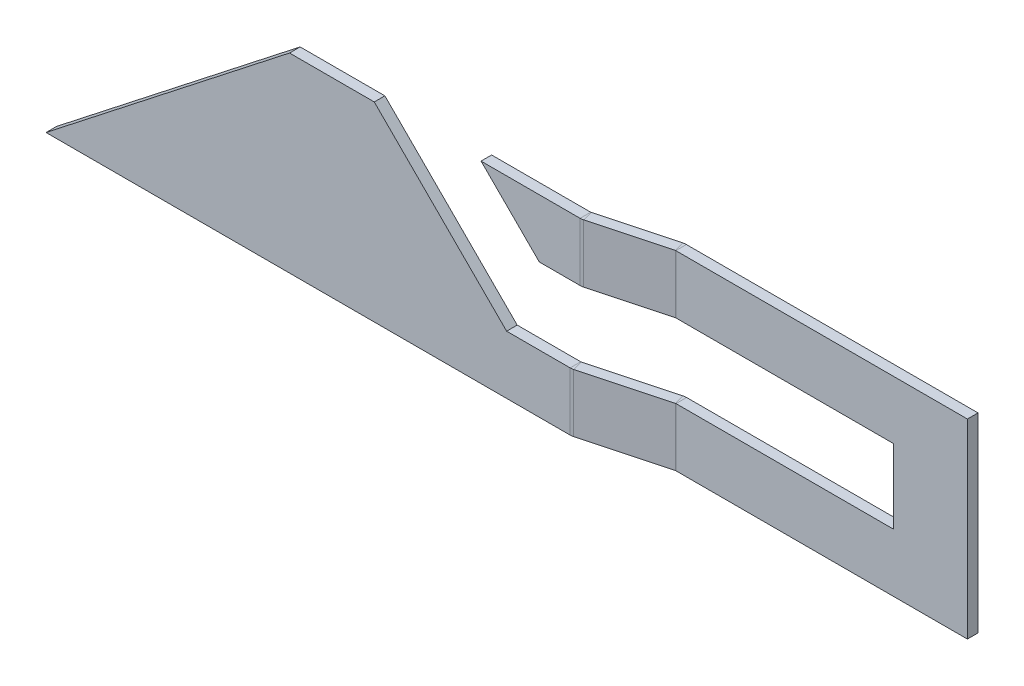
ISO-10303-21;
HEADER;
FILE_DESCRIPTION(('STEP AP214'),'2;1');
FILE_NAME('part.step','',(''),(''),'','','');
FILE_SCHEMA(('AUTOMOTIVE_DESIGN { 1 0 10303 214 1 1 1 1 }'));
ENDSEC;
DATA;
#1=APPLICATION_CONTEXT('core data for automotive mechanical design processes');
#2=APPLICATION_PROTOCOL_DEFINITION('international standard','automotive_design',2000,#1);
#3=PRODUCT_CONTEXT('',#1,'mechanical');
#4=PRODUCT('Part','Part','',(#3));
#5=PRODUCT_RELATED_PRODUCT_CATEGORY('part','',(#4));
#6=PRODUCT_DEFINITION_FORMATION('','',#4);
#7=PRODUCT_DEFINITION_CONTEXT('part definition',#1,'design');
#8=PRODUCT_DEFINITION('design','',#6,#7);
#9=PRODUCT_DEFINITION_SHAPE('','',#8);
#10=(LENGTH_UNIT() NAMED_UNIT(*) SI_UNIT(.MILLI.,.METRE.));
#11=(NAMED_UNIT(*) PLANE_ANGLE_UNIT() SI_UNIT($,.RADIAN.));
#12=(NAMED_UNIT(*) SI_UNIT($,.STERADIAN.) SOLID_ANGLE_UNIT());
#13=UNCERTAINTY_MEASURE_WITH_UNIT(LENGTH_MEASURE(1.E-05),#10,'distance_accuracy_value','');
#14=(GEOMETRIC_REPRESENTATION_CONTEXT(3) GLOBAL_UNCERTAINTY_ASSIGNED_CONTEXT((#13)) GLOBAL_UNIT_ASSIGNED_CONTEXT((#10,
#11,#12)) REPRESENTATION_CONTEXT('',''));
#15=CARTESIAN_POINT('',(0.,0.,0.));
#16=DIRECTION('',(0.,0.,1.));
#17=DIRECTION('',(1.,0.,0.));
#18=AXIS2_PLACEMENT_3D('',#15,#16,#17);
#19=CARTESIAN_POINT('',(0.,0.,-5.));
#20=DIRECTION('',(0.,-1.,0.));
#21=DIRECTION('',(1.,0.,0.));
#22=AXIS2_PLACEMENT_3D('',#19,#20,#21);
#23=PLANE('',#22);
#24=DIRECTION('',(1.,0.,0.));
#25=VECTOR('',#24,1.);
#26=CARTESIAN_POINT('',(0.,0.,0.));
#27=LINE('',#26,#25);
#28=CARTESIAN_POINT('',(-117.797199499532,0.,0.));
#29=VERTEX_POINT('',#28);
#30=CARTESIAN_POINT('',(129.702800500468,0.,0.));
#31=VERTEX_POINT('',#30);
#32=EDGE_CURVE('E541',#29,#31,#27,.T.);
#33=ORIENTED_EDGE('',*,*,#32,.F.);
#34=DIRECTION('',(0.,0.,1.));
#35=VECTOR('',#34,1.);
#36=CARTESIAN_POINT('',(-117.797199499532,0.,-5.));
#37=LINE('',#36,#35);
#38=CARTESIAN_POINT('',(-117.797199499532,0.,-5.));
#39=VERTEX_POINT('',#38);
#40=EDGE_CURVE('E13',#39,#29,#37,.T.);
#41=ORIENTED_EDGE('',*,*,#40,.F.);
#42=DIRECTION('',(1.,0.,0.));
#43=VECTOR('',#42,1.);
#44=CARTESIAN_POINT('',(129.702800500468,0.,-5.));
#45=LINE('',#44,#43);
#46=CARTESIAN_POINT('',(129.702800500468,0.,-4.99999999999999));
#47=VERTEX_POINT('',#46);
#48=EDGE_CURVE('E156',#39,#47,#45,.T.);
#49=ORIENTED_EDGE('',*,*,#48,.T.);
#50=DIRECTION('',(0.,0.,1.));
#51=VECTOR('',#50,1.);
#52=CARTESIAN_POINT('',(129.702800500468,0.,-5.));
#53=LINE('',#52,#51);
#54=EDGE_CURVE('E141',#47,#31,#53,.T.);
#55=ORIENTED_EDGE('',*,*,#54,.T.);
#56=EDGE_LOOP('',(#33,#41,#49,#55));
#57=FACE_BOUND('',#56,.T.);
#58=ADVANCED_FACE('F137',(#57),#23,.T.);
#59=CARTESIAN_POINT('',(-117.797199499532,0.,-5.));
#60=DIRECTION('',(-0.616308261658111,0.787505001007586,0.));
#61=DIRECTION('',(-0.787505001007586,-0.616308261658111,0.));
#62=AXIS2_PLACEMENT_3D('',#59,#60,#61);
#63=PLANE('',#62);
#64=DIRECTION('',(-0.787505001007586,-0.616308261658111,0.));
#65=VECTOR('',#64,1.);
#66=CARTESIAN_POINT('',(-117.797199499532,0.,0.));
#67=LINE('',#66,#65);
#68=CARTESIAN_POINT('',(-2.79719949953231,90.,0.));
#69=VERTEX_POINT('',#68);
#70=EDGE_CURVE('E563',#69,#29,#67,.T.);
#71=ORIENTED_EDGE('',*,*,#70,.F.);
#72=DIRECTION('',(0.,0.,1.));
#73=VECTOR('',#72,1.);
#74=CARTESIAN_POINT('',(-2.79719949953231,90.,-5.));
#75=LINE('',#74,#73);
#76=CARTESIAN_POINT('',(-2.79719949953231,90.,-5.));
#77=VERTEX_POINT('',#76);
#78=EDGE_CURVE('E147',#77,#69,#75,.T.);
#79=ORIENTED_EDGE('',*,*,#78,.F.);
#80=DIRECTION('',(-0.787505001007586,-0.616308261658111,0.));
#81=VECTOR('',#80,1.);
#82=CARTESIAN_POINT('',(-117.797199499532,0.,-5.));
#83=LINE('',#82,#81);
#84=EDGE_CURVE('E550',#77,#39,#83,.T.);
#85=ORIENTED_EDGE('',*,*,#84,.T.);
#86=ORIENTED_EDGE('',*,*,#40,.T.);
#87=EDGE_LOOP('',(#71,#79,#85,#86));
#88=FACE_BOUND('',#87,.T.);
#89=ADVANCED_FACE('F699',(#88),#63,.T.);
#90=CARTESIAN_POINT('',(-2.79719949953231,90.,-5.));
#91=DIRECTION('',(0.,1.,0.));
#92=DIRECTION('',(0.,0.,1.));
#93=AXIS2_PLACEMENT_3D('',#90,#91,#92);
#94=PLANE('',#93);
#95=DIRECTION('',(-1.,0.,0.));
#96=VECTOR('',#95,1.);
#97=CARTESIAN_POINT('',(-2.79719949953231,90.,0.));
#98=LINE('',#97,#96);
#99=CARTESIAN_POINT('',(37.2028005004677,90.,0.));
#100=VERTEX_POINT('',#99);
#101=EDGE_CURVE('E560',#100,#69,#98,.T.);
#102=ORIENTED_EDGE('',*,*,#101,.F.);
#103=DIRECTION('',(0.,0.,1.));
#104=VECTOR('',#103,1.);
#105=CARTESIAN_POINT('',(37.2028005004677,90.,-5.));
#106=LINE('',#105,#104);
#107=CARTESIAN_POINT('',(37.2028005004677,90.,-5.));
#108=VERTEX_POINT('',#107);
#109=EDGE_CURVE('E568',#108,#100,#106,.T.);
#110=ORIENTED_EDGE('',*,*,#109,.F.);
#111=DIRECTION('',(-1.,0.,0.));
#112=VECTOR('',#111,1.);
#113=CARTESIAN_POINT('',(-2.79719949953231,90.,-5.));
#114=LINE('',#113,#112);
#115=EDGE_CURVE('E548',#108,#77,#114,.T.);
#116=ORIENTED_EDGE('',*,*,#115,.T.);
#117=ORIENTED_EDGE('',*,*,#78,.T.);
#118=EDGE_LOOP('',(#102,#110,#116,#117));
#119=FACE_BOUND('',#118,.T.);
#120=ADVANCED_FACE('F704',(#119),#94,.T.);
#121=CARTESIAN_POINT('',(37.2028005004677,90.,-5.));
#122=DIRECTION('',(0.707106781186548,0.707106781186548,0.));
#123=DIRECTION('',(-0.707106781186548,0.707106781186548,0.));
#124=AXIS2_PLACEMENT_3D('',#121,#122,#123);
#125=PLANE('',#124);
#126=DIRECTION('',(-0.707106781186548,0.707106781186548,0.));
#127=VECTOR('',#126,1.);
#128=CARTESIAN_POINT('',(37.2028005004677,90.,0.));
#129=LINE('',#128,#127);
#130=CARTESIAN_POINT('',(99.7028005004677,27.5,0.));
#131=VERTEX_POINT('',#130);
#132=EDGE_CURVE('E557',#131,#100,#129,.T.);
#133=ORIENTED_EDGE('',*,*,#132,.F.);
#134=DIRECTION('',(0.,0.,1.));
#135=VECTOR('',#134,1.);
#136=CARTESIAN_POINT('',(99.7028005004677,27.5,-5.));
#137=LINE('',#136,#135);
#138=CARTESIAN_POINT('',(99.7028005004677,27.5,-5.));
#139=VERTEX_POINT('',#138);
#140=EDGE_CURVE('E187',#139,#131,#137,.T.);
#141=ORIENTED_EDGE('',*,*,#140,.F.);
#142=DIRECTION('',(-0.707106781186548,0.707106781186548,0.));
#143=VECTOR('',#142,1.);
#144=CARTESIAN_POINT('',(37.2028005004677,90.,-5.));
#145=LINE('',#144,#143);
#146=EDGE_CURVE('E546',#139,#108,#145,.T.);
#147=ORIENTED_EDGE('',*,*,#146,.T.);
#148=ORIENTED_EDGE('',*,*,#109,.T.);
#149=EDGE_LOOP('',(#133,#141,#147,#148));
#150=FACE_BOUND('',#149,.T.);
#151=ADVANCED_FACE('F710',(#150),#125,.T.);
#152=CARTESIAN_POINT('',(99.7028005004677,27.5,-5.));
#153=DIRECTION('',(0.,1.,0.));
#154=DIRECTION('',(0.,0.,1.));
#155=AXIS2_PLACEMENT_3D('',#152,#153,#154);
#156=PLANE('',#155);
#157=DIRECTION('',(-1.,0.,0.));
#158=VECTOR('',#157,1.);
#159=CARTESIAN_POINT('',(99.7028005004677,27.5,0.));
#160=LINE('',#159,#158);
#161=CARTESIAN_POINT('',(129.702800500468,27.5,0.));
#162=VERTEX_POINT('',#161);
#163=EDGE_CURVE('E554',#162,#131,#160,.T.);
#164=ORIENTED_EDGE('',*,*,#163,.F.);
#165=DIRECTION('',(0.,0.,1.));
#166=VECTOR('',#165,1.);
#167=CARTESIAN_POINT('',(129.702800500468,27.5,-5.));
#168=LINE('',#167,#166);
#169=CARTESIAN_POINT('',(129.702800500468,27.5,-4.99999999999999));
#170=VERTEX_POINT('',#169);
#171=EDGE_CURVE('E570',#170,#162,#168,.T.);
#172=ORIENTED_EDGE('',*,*,#171,.F.);
#173=DIRECTION('',(-1.,0.,0.));
#174=VECTOR('',#173,1.);
#175=CARTESIAN_POINT('',(99.7028005004677,27.5,-5.));
#176=LINE('',#175,#174);
#177=EDGE_CURVE('E543',#170,#139,#176,.T.);
#178=ORIENTED_EDGE('',*,*,#177,.T.);
#179=ORIENTED_EDGE('',*,*,#140,.T.);
#180=EDGE_LOOP('',(#164,#172,#178,#179));
#181=FACE_BOUND('',#180,.T.);
#182=ADVANCED_FACE('F139',(#181),#156,.T.);
#183=CARTESIAN_POINT('',(0.,0.,-5.));
#184=DIRECTION('',(0.,0.,1.));
#185=DIRECTION('',(1.,0.,0.));
#186=AXIS2_PLACEMENT_3D('',#183,#184,#185);
#187=PLANE('',#186);
#188=ORIENTED_EDGE('',*,*,#48,.F.);
#189=ORIENTED_EDGE('',*,*,#84,.F.);
#190=ORIENTED_EDGE('',*,*,#115,.F.);
#191=ORIENTED_EDGE('',*,*,#146,.F.);
#192=ORIENTED_EDGE('',*,*,#177,.F.);
#193=DIRECTION('',(0.,1.,0.));
#194=VECTOR('',#193,1.);
#195=CARTESIAN_POINT('',(129.702800500468,27.5,-5.));
#196=LINE('',#195,#194);
#197=EDGE_CURVE('E540',#47,#170,#196,.T.);
#198=ORIENTED_EDGE('',*,*,#197,.F.);
#199=EDGE_LOOP('',(#188,#189,#190,#191,#192,#198));
#200=FACE_BOUND('',#199,.T.);
#201=ADVANCED_FACE('F587',(#200),#187,.F.);
#202=CARTESIAN_POINT('',(0.,0.,0.));
#203=DIRECTION('',(0.,0.,1.));
#204=DIRECTION('',(1.,0.,0.));
#205=AXIS2_PLACEMENT_3D('',#202,#203,#204);
#206=PLANE('',#205);
#207=ORIENTED_EDGE('',*,*,#32,.T.);
#208=DIRECTION('',(0.,1.,0.));
#209=VECTOR('',#208,1.);
#210=CARTESIAN_POINT('',(129.702800500468,27.5,0.));
#211=LINE('',#210,#209);
#212=EDGE_CURVE('E530',#31,#162,#211,.T.);
#213=ORIENTED_EDGE('',*,*,#212,.T.);
#214=ORIENTED_EDGE('',*,*,#163,.T.);
#215=ORIENTED_EDGE('',*,*,#132,.T.);
#216=ORIENTED_EDGE('',*,*,#101,.T.);
#217=ORIENTED_EDGE('',*,*,#70,.T.);
#218=EDGE_LOOP('',(#207,#213,#214,#215,#216,#217));
#219=FACE_BOUND('',#218,.T.);
#220=ADVANCED_FACE('F591',(#219),#206,.T.);
#221=CARTESIAN_POINT('',(129.702800500468,27.5,-5.73660000000001));
#222=DIRECTION('',(0.,1.,0.));
#223=DIRECTION('',(0.,0.,1.));
#224=AXIS2_PLACEMENT_3D('',#221,#222,#223);
#225=PLANE('',#224);
#226=DIRECTION('',(0.258819045102515,0.,0.96592582628907));
#227=VECTOR('',#226,1.);
#228=CARTESIAN_POINT('',(131.187541834603,27.5,-0.195469904910118));
#229=LINE('',#228,#227);
#230=CARTESIAN_POINT('',(129.89344660909,27.5,-5.02509903635547));
#231=VERTEX_POINT('',#230);
#232=CARTESIAN_POINT('',(131.187541834603,27.5,-0.195469904910119));
#233=VERTEX_POINT('',#232);
#234=EDGE_CURVE('E485',#231,#233,#229,.T.);
#235=ORIENTED_EDGE('',*,*,#234,.F.);
#236=CARTESIAN_POINT('',(129.702800500468,27.5,-5.73660000000001));
#237=DIRECTION('',(0.,-1.,0.));
#238=DIRECTION('',(0.,0.,-1.));
#239=AXIS2_PLACEMENT_3D('',#236,#237,#238);
#240=CIRCLE('',#239,0.736600000000015);
#241=EDGE_CURVE('E534',#170,#231,#240,.F.);
#242=ORIENTED_EDGE('',*,*,#241,.F.);
#243=ORIENTED_EDGE('',*,*,#171,.T.);
#244=CARTESIAN_POINT('',(129.702800500468,27.5,-5.73660000000001));
#245=DIRECTION('',(0.,-1.,0.));
#246=DIRECTION('',(0.,0.,-1.));
#247=AXIS2_PLACEMENT_3D('',#244,#245,#246);
#248=CIRCLE('',#247,5.73660000000001);
#249=EDGE_CURVE('E527',#162,#233,#248,.F.);
#250=ORIENTED_EDGE('',*,*,#249,.T.);
#251=EDGE_LOOP('',(#235,#242,#243,#250));
#252=FACE_BOUND('',#251,.T.);
#253=ADVANCED_FACE('F595',(#252),#225,.T.);
#254=CARTESIAN_POINT('',(129.702800500468,0.,-5.73660000000001));
#255=DIRECTION('',(0.,1.,0.));
#256=DIRECTION('',(0.,0.,1.));
#257=AXIS2_PLACEMENT_3D('',#254,#255,#256);
#258=PLANE('',#257);
#259=CARTESIAN_POINT('',(129.702800500468,0.,-5.73660000000001));
#260=DIRECTION('',(0.,-1.,0.));
#261=DIRECTION('',(0.,0.,-1.));
#262=AXIS2_PLACEMENT_3D('',#259,#260,#261);
#263=CIRCLE('',#262,0.736600000000015);
#264=CARTESIAN_POINT('',(129.89344660909,0.,-5.02509903635547));
#265=VERTEX_POINT('',#264);
#266=EDGE_CURVE('E497',#265,#47,#263,.T.);
#267=ORIENTED_EDGE('',*,*,#266,.F.);
#268=DIRECTION('',(0.258819045102515,0.,0.96592582628907));
#269=VECTOR('',#268,1.);
#270=CARTESIAN_POINT('',(129.89344660909,0.,-5.02509903635547));
#271=LINE('',#270,#269);
#272=CARTESIAN_POINT('',(131.187541834603,0.,-0.195469904910119));
#273=VERTEX_POINT('',#272);
#274=EDGE_CURVE('E520',#265,#273,#271,.T.);
#275=ORIENTED_EDGE('',*,*,#274,.T.);
#276=CARTESIAN_POINT('',(129.702800500468,0.,-5.73660000000001));
#277=DIRECTION('',(0.,-1.,0.));
#278=DIRECTION('',(0.,0.,-1.));
#279=AXIS2_PLACEMENT_3D('',#276,#277,#278);
#280=CIRCLE('',#279,5.73660000000001);
#281=EDGE_CURVE('E531',#273,#31,#280,.T.);
#282=ORIENTED_EDGE('',*,*,#281,.T.);
#283=ORIENTED_EDGE('',*,*,#54,.F.);
#284=EDGE_LOOP('',(#267,#275,#282,#283));
#285=FACE_BOUND('',#284,.T.);
#286=ADVANCED_FACE('F581',(#285),#258,.F.);
#287=CARTESIAN_POINT('',(129.702800500468,0.,-5.73660000000001));
#288=DIRECTION('',(0.,-1.,0.));
#289=DIRECTION('',(0.258819045102515,0.,0.96592582628907));
#290=AXIS2_PLACEMENT_3D('',#287,#288,#289);
#291=CYLINDRICAL_SURFACE('',#290,5.73660000000001);
#292=ORIENTED_EDGE('',*,*,#212,.F.);
#293=ORIENTED_EDGE('',*,*,#281,.F.);
#294=DIRECTION('',(0.,-1.,0.));
#295=VECTOR('',#294,1.);
#296=CARTESIAN_POINT('',(131.187541834603,27.5,-0.195469904910119));
#297=LINE('',#296,#295);
#298=EDGE_CURVE('E518',#273,#233,#297,.F.);
#299=ORIENTED_EDGE('',*,*,#298,.T.);
#300=ORIENTED_EDGE('',*,*,#249,.F.);
#301=EDGE_LOOP('',(#292,#293,#299,#300));
#302=FACE_BOUND('',#301,.T.);
#303=ADVANCED_FACE('F593',(#302),#291,.T.);
#304=CARTESIAN_POINT('',(129.702800500468,0.,-5.73660000000001));
#305=DIRECTION('',(0.,-1.,0.));
#306=DIRECTION('',(0.258819045102515,0.,0.96592582628907));
#307=AXIS2_PLACEMENT_3D('',#304,#305,#306);
#308=CYLINDRICAL_SURFACE('',#307,0.736600000000015);
#309=ORIENTED_EDGE('',*,*,#197,.T.);
#310=ORIENTED_EDGE('',*,*,#241,.T.);
#311=DIRECTION('',(0.,-1.,0.));
#312=VECTOR('',#311,1.);
#313=CARTESIAN_POINT('',(129.89344660909,27.5,-5.02509903635547));
#314=LINE('',#313,#312);
#315=EDGE_CURVE('E523',#231,#265,#314,.T.);
#316=ORIENTED_EDGE('',*,*,#315,.T.);
#317=ORIENTED_EDGE('',*,*,#266,.T.);
#318=EDGE_LOOP('',(#309,#310,#316,#317));
#319=FACE_BOUND('',#318,.T.);
#320=ADVANCED_FACE('F584',(#319),#308,.F.);
#321=CARTESIAN_POINT('',(131.093870955703,27.5,-0.170370868554648));
#322=DIRECTION('',(0.,1.,0.));
#323=DIRECTION('',(0.,0.,1.));
#324=AXIS2_PLACEMENT_3D('',#321,#322,#323);
#325=PLANE('',#324);
#326=DIRECTION('',(0.96592582628907,0.,-0.258819045102515));
#327=VECTOR('',#326,1.);
#328=CARTESIAN_POINT('',(7.53541539226132,27.5,27.7606366156551));
#329=LINE('',#328,#327);
#330=CARTESIAN_POINT('',(167.800976044178,27.5,-15.1823909355459));
#331=VERTEX_POINT('',#330);
#332=EDGE_CURVE('E515',#231,#331,#329,.T.);
#333=ORIENTED_EDGE('',*,*,#332,.F.);
#334=ORIENTED_EDGE('',*,*,#234,.T.);
#335=DIRECTION('',(-0.96592582628907,0.,0.258819045102515));
#336=VECTOR('',#335,1.);
#337=CARTESIAN_POINT('',(131.093870955703,27.5,-0.170370868554648));
#338=LINE('',#337,#336);
#339=CARTESIAN_POINT('',(169.09507126969,27.5,-10.3527618041006));
#340=VERTEX_POINT('',#339);
#341=EDGE_CURVE('E506',#233,#340,#338,.F.);
#342=ORIENTED_EDGE('',*,*,#341,.T.);
#343=DIRECTION('',(-0.258819045102515,0.,-0.96592582628907));
#344=VECTOR('',#343,1.);
#345=CARTESIAN_POINT('',(169.09507126969,27.5,-10.3527618041006));
#346=LINE('',#345,#344);
#347=EDGE_CURVE('E498',#340,#331,#346,.T.);
#348=ORIENTED_EDGE('',*,*,#347,.T.);
#349=EDGE_LOOP('',(#333,#334,#342,#348));
#350=FACE_BOUND('',#349,.T.);
#351=ADVANCED_FACE('F599',(#350),#325,.T.);
#352=CARTESIAN_POINT('',(169.09507126969,0.,-10.3527618041006));
#353=DIRECTION('',(0.,-1.,0.));
#354=DIRECTION('',(0.,0.,-1.));
#355=AXIS2_PLACEMENT_3D('',#352,#353,#354);
#356=PLANE('',#355);
#357=DIRECTION('',(0.96592582628907,0.,-0.258819045102515));
#358=VECTOR('',#357,1.);
#359=CARTESIAN_POINT('',(169.09507126969,0.,-10.3527618041006));
#360=LINE('',#359,#358);
#361=CARTESIAN_POINT('',(169.09507126969,0.,-10.3527618041006));
#362=VERTEX_POINT('',#361);
#363=EDGE_CURVE('E501',#362,#273,#360,.F.);
#364=ORIENTED_EDGE('',*,*,#363,.T.);
#365=ORIENTED_EDGE('',*,*,#274,.F.);
#366=DIRECTION('',(-0.96592582628907,0.,0.258819045102515));
#367=VECTOR('',#366,1.);
#368=CARTESIAN_POINT('',(7.53541539226132,0.,27.7606366156551));
#369=LINE('',#368,#367);
#370=CARTESIAN_POINT('',(167.800976044178,0.,-15.1823909355459));
#371=VERTEX_POINT('',#370);
#372=EDGE_CURVE('E509',#371,#265,#369,.T.);
#373=ORIENTED_EDGE('',*,*,#372,.F.);
#374=DIRECTION('',(-0.258819045102515,0.,-0.96592582628907));
#375=VECTOR('',#374,1.);
#376=CARTESIAN_POINT('',(169.09507126969,0.,-10.3527618041006));
#377=LINE('',#376,#375);
#378=EDGE_CURVE('E494',#362,#371,#377,.T.);
#379=ORIENTED_EDGE('',*,*,#378,.F.);
#380=EDGE_LOOP('',(#364,#365,#373,#379));
#381=FACE_BOUND('',#380,.T.);
#382=ADVANCED_FACE('F614',(#381),#356,.T.);
#383=CARTESIAN_POINT('',(8.8295106177739,0.,32.5902657471004));
#384=DIRECTION('',(-0.258819045102515,0.,-0.96592582628907));
#385=DIRECTION('',(-0.96592582628907,0.,0.258819045102515));
#386=AXIS2_PLACEMENT_3D('',#383,#384,#385);
#387=PLANE('',#386);
#388=ORIENTED_EDGE('',*,*,#298,.F.);
#389=ORIENTED_EDGE('',*,*,#363,.F.);
#390=DIRECTION('',(0.,1.,0.));
#391=VECTOR('',#390,1.);
#392=CARTESIAN_POINT('',(169.09507126969,27.5,-10.3527618041006));
#393=LINE('',#392,#391);
#394=EDGE_CURVE('E504',#340,#362,#393,.F.);
#395=ORIENTED_EDGE('',*,*,#394,.F.);
#396=ORIENTED_EDGE('',*,*,#341,.F.);
#397=EDGE_LOOP('',(#388,#389,#395,#396));
#398=FACE_BOUND('',#397,.T.);
#399=ADVANCED_FACE('F602',(#398),#387,.F.);
#400=CARTESIAN_POINT('',(7.53541539226132,0.,27.7606366156551));
#401=DIRECTION('',(-0.258819045102515,0.,-0.96592582628907));
#402=DIRECTION('',(-0.96592582628907,0.,0.258819045102515));
#403=AXIS2_PLACEMENT_3D('',#400,#401,#402);
#404=PLANE('',#403);
#405=ORIENTED_EDGE('',*,*,#372,.T.);
#406=ORIENTED_EDGE('',*,*,#315,.F.);
#407=ORIENTED_EDGE('',*,*,#332,.T.);
#408=DIRECTION('',(0.,-1.,0.));
#409=VECTOR('',#408,1.);
#410=CARTESIAN_POINT('',(167.800976044178,0.,-15.1823909355459));
#411=LINE('',#410,#409);
#412=EDGE_CURVE('E512',#331,#371,#411,.T.);
#413=ORIENTED_EDGE('',*,*,#412,.T.);
#414=EDGE_LOOP('',(#405,#406,#407,#413));
#415=FACE_BOUND('',#414,.T.);
#416=ADVANCED_FACE('F616',(#415),#404,.T.);
#417=CARTESIAN_POINT('',(169.285717378313,0.,-9.64126084045614));
#418=DIRECTION('',(0.,-1.,0.));
#419=DIRECTION('',(0.,0.,-1.));
#420=AXIS2_PLACEMENT_3D('',#417,#418,#419);
#421=PLANE('',#420);
#422=DIRECTION('',(0.,0.,-1.));
#423=VECTOR('',#422,1.);
#424=CARTESIAN_POINT('',(169.285717378313,0.,-15.3778608404561));
#425=LINE('',#424,#423);
#426=CARTESIAN_POINT('',(169.285717378313,0.,-10.3778608404561));
#427=VERTEX_POINT('',#426);
#428=CARTESIAN_POINT('',(169.285717378313,0.,-15.3778608404561));
#429=VERTEX_POINT('',#428);
#430=EDGE_CURVE('E409',#427,#429,#425,.T.);
#431=ORIENTED_EDGE('',*,*,#430,.F.);
#432=CARTESIAN_POINT('',(169.285717378313,0.,-9.64126084045614));
#433=DIRECTION('',(0.,1.,0.));
#434=DIRECTION('',(0.,0.,1.));
#435=AXIS2_PLACEMENT_3D('',#432,#433,#434);
#436=CIRCLE('',#435,0.736599999999915);
#437=EDGE_CURVE('E489',#362,#427,#436,.F.);
#438=ORIENTED_EDGE('',*,*,#437,.F.);
#439=ORIENTED_EDGE('',*,*,#378,.T.);
#440=CARTESIAN_POINT('',(169.285717378313,0.,-9.64126084045614));
#441=DIRECTION('',(0.,1.,0.));
#442=DIRECTION('',(0.,0.,1.));
#443=AXIS2_PLACEMENT_3D('',#440,#441,#442);
#444=CIRCLE('',#443,5.73659999999992);
#445=EDGE_CURVE('E482',#371,#429,#444,.F.);
#446=ORIENTED_EDGE('',*,*,#445,.T.);
#447=EDGE_LOOP('',(#431,#438,#439,#446));
#448=FACE_BOUND('',#447,.T.);
#449=ADVANCED_FACE('F611',(#448),#421,.T.);
#450=CARTESIAN_POINT('',(169.285717378313,27.5,-9.64126084045614));
#451=DIRECTION('',(0.,-1.,0.));
#452=DIRECTION('',(0.,0.,-1.));
#453=AXIS2_PLACEMENT_3D('',#450,#451,#452);
#454=PLANE('',#453);
#455=CARTESIAN_POINT('',(169.285717378313,27.5,-9.64126084045614));
#456=DIRECTION('',(0.,1.,0.));
#457=DIRECTION('',(0.,0.,1.));
#458=AXIS2_PLACEMENT_3D('',#455,#456,#457);
#459=CIRCLE('',#458,0.736599999999915);
#460=CARTESIAN_POINT('',(169.285717378313,27.5,-10.3778608404561));
#461=VERTEX_POINT('',#460);
#462=EDGE_CURVE('E420',#461,#340,#459,.T.);
#463=ORIENTED_EDGE('',*,*,#462,.F.);
#464=DIRECTION('',(0.,0.,-1.));
#465=VECTOR('',#464,1.);
#466=CARTESIAN_POINT('',(169.285717378313,27.5,-10.377860840456));
#467=LINE('',#466,#465);
#468=CARTESIAN_POINT('',(169.285717378313,27.5,-15.3778608404561));
#469=VERTEX_POINT('',#468);
#470=EDGE_CURVE('E475',#461,#469,#467,.T.);
#471=ORIENTED_EDGE('',*,*,#470,.T.);
#472=CARTESIAN_POINT('',(169.285717378313,27.5,-9.64126084045614));
#473=DIRECTION('',(0.,1.,0.));
#474=DIRECTION('',(0.,0.,1.));
#475=AXIS2_PLACEMENT_3D('',#472,#473,#474);
#476=CIRCLE('',#475,5.73659999999992);
#477=EDGE_CURVE('E486',#469,#331,#476,.T.);
#478=ORIENTED_EDGE('',*,*,#477,.T.);
#479=ORIENTED_EDGE('',*,*,#347,.F.);
#480=EDGE_LOOP('',(#463,#471,#478,#479));
#481=FACE_BOUND('',#480,.T.);
#482=ADVANCED_FACE('F620',(#481),#454,.F.);
#483=CARTESIAN_POINT('',(169.285717378313,27.5,-9.64126084045614));
#484=DIRECTION('',(0.,1.,0.));
#485=DIRECTION('',(0.,0.,-1.));
#486=AXIS2_PLACEMENT_3D('',#483,#484,#485);
#487=CYLINDRICAL_SURFACE('',#486,5.73659999999992);
#488=ORIENTED_EDGE('',*,*,#412,.F.);
#489=ORIENTED_EDGE('',*,*,#477,.F.);
#490=DIRECTION('',(0.,1.,0.));
#491=VECTOR('',#490,1.);
#492=CARTESIAN_POINT('',(169.285717378313,0.,-15.3778608404561));
#493=LINE('',#492,#491);
#494=EDGE_CURVE('E473',#469,#429,#493,.F.);
#495=ORIENTED_EDGE('',*,*,#494,.T.);
#496=ORIENTED_EDGE('',*,*,#445,.F.);
#497=EDGE_LOOP('',(#488,#489,#495,#496));
#498=FACE_BOUND('',#497,.T.);
#499=ADVANCED_FACE('F618',(#498),#487,.T.);
#500=CARTESIAN_POINT('',(169.285717378313,27.5,-9.64126084045614));
#501=DIRECTION('',(0.,1.,0.));
#502=DIRECTION('',(0.,0.,-1.));
#503=AXIS2_PLACEMENT_3D('',#500,#501,#502);
#504=CYLINDRICAL_SURFACE('',#503,0.736599999999915);
#505=ORIENTED_EDGE('',*,*,#394,.T.);
#506=ORIENTED_EDGE('',*,*,#437,.T.);
#507=DIRECTION('',(0.,1.,0.));
#508=VECTOR('',#507,1.);
#509=CARTESIAN_POINT('',(169.285717378313,0.,-10.3778608404561));
#510=LINE('',#509,#508);
#511=EDGE_CURVE('E478',#427,#461,#510,.T.);
#512=ORIENTED_EDGE('',*,*,#511,.T.);
#513=ORIENTED_EDGE('',*,*,#462,.T.);
#514=EDGE_LOOP('',(#505,#506,#512,#513));
#515=FACE_BOUND('',#514,.T.);
#516=ADVANCED_FACE('F606',(#515),#504,.F.);
#517=CARTESIAN_POINT('',(169.18874214859,0.,-15.3778608404561));
#518=DIRECTION('',(0.,-1.,0.));
#519=DIRECTION('',(0.,0.,-1.));
#520=AXIS2_PLACEMENT_3D('',#517,#518,#519);
#521=PLANE('',#520);
#522=DIRECTION('',(1.,0.,0.));
#523=VECTOR('',#522,1.);
#524=CARTESIAN_POINT('',(0.0936708788996386,0.,-10.377860840456));
#525=LINE('',#524,#523);
#526=CARTESIAN_POINT('',(306.891485589345,0.,-10.3778608404561));
#527=VERTEX_POINT('',#526);
#528=EDGE_CURVE('E471',#427,#527,#525,.T.);
#529=ORIENTED_EDGE('',*,*,#528,.F.);
#530=ORIENTED_EDGE('',*,*,#430,.T.);
#531=DIRECTION('',(-1.,0.,0.));
#532=VECTOR('',#531,1.);
#533=CARTESIAN_POINT('',(169.18874214859,0.,-15.3778608404561));
#534=LINE('',#533,#532);
#535=CARTESIAN_POINT('',(306.891485589345,0.,-15.3778608404561));
#536=VERTEX_POINT('',#535);
#537=EDGE_CURVE('E451',#429,#536,#534,.F.);
#538=ORIENTED_EDGE('',*,*,#537,.T.);
#539=DIRECTION('',(0.,0.,1.));
#540=VECTOR('',#539,1.);
#541=CARTESIAN_POINT('',(306.891485589345,0.,-15.3778608404561));
#542=LINE('',#541,#540);
#543=EDGE_CURVE('E430',#536,#527,#542,.T.);
#544=ORIENTED_EDGE('',*,*,#543,.T.);
#545=EDGE_LOOP('',(#529,#530,#538,#544));
#546=FACE_BOUND('',#545,.T.);
#547=ADVANCED_FACE('F744',(#546),#521,.T.);
#548=CARTESIAN_POINT('',(0.0936708788996385,0.,-15.377860840456));
#549=DIRECTION('',(0.,0.,1.));
#550=DIRECTION('',(0.,-1.,0.));
#551=AXIS2_PLACEMENT_3D('',#548,#549,#550);
#552=PLANE('',#551);
#553=ORIENTED_EDGE('',*,*,#494,.F.);
#554=DIRECTION('',(1.,0.,0.));
#555=VECTOR('',#554,1.);
#556=CARTESIAN_POINT('',(169.18874214859,27.5,-15.3778608404561));
#557=LINE('',#556,#555);
#558=CARTESIAN_POINT('',(271.891485589345,27.5,-15.3778608404561));
#559=VERTEX_POINT('',#558);
#560=EDGE_CURVE('E433',#559,#469,#557,.F.);
#561=ORIENTED_EDGE('',*,*,#560,.F.);
#562=DIRECTION('',(0.,1.,0.));
#563=VECTOR('',#562,1.);
#564=CARTESIAN_POINT('',(271.891485589345,27.5,-15.3778608404561));
#565=LINE('',#564,#563);
#566=CARTESIAN_POINT('',(271.891485589345,62.5,-15.3778608404561));
#567=VERTEX_POINT('',#566);
#568=EDGE_CURVE('E436',#567,#559,#565,.F.);
#569=ORIENTED_EDGE('',*,*,#568,.F.);
#570=DIRECTION('',(-1.,0.,0.));
#571=VECTOR('',#570,1.);
#572=CARTESIAN_POINT('',(271.891485589345,62.5,-15.3778608404561));
#573=LINE('',#572,#571);
#574=CARTESIAN_POINT('',(169.18874214859,62.5,-15.377860840456));
#575=VERTEX_POINT('',#574);
#576=EDGE_CURVE('E439',#575,#567,#573,.F.);
#577=ORIENTED_EDGE('',*,*,#576,.F.);
#578=DIRECTION('',(0.,1.,0.));
#579=VECTOR('',#578,1.);
#580=CARTESIAN_POINT('',(169.18874214859,62.5,-15.377860840456));
#581=LINE('',#580,#579);
#582=CARTESIAN_POINT('',(169.18874214859,90.,-15.377860840456));
#583=VERTEX_POINT('',#582);
#584=EDGE_CURVE('E442',#583,#575,#581,.F.);
#585=ORIENTED_EDGE('',*,*,#584,.F.);
#586=DIRECTION('',(1.,0.,0.));
#587=VECTOR('',#586,1.);
#588=CARTESIAN_POINT('',(169.18874214859,90.,-15.377860840456));
#589=LINE('',#588,#587);
#590=CARTESIAN_POINT('',(306.891485589345,90.,-15.377860840456));
#591=VERTEX_POINT('',#590);
#592=EDGE_CURVE('E445',#591,#583,#589,.F.);
#593=ORIENTED_EDGE('',*,*,#592,.F.);
#594=DIRECTION('',(0.,-1.,0.));
#595=VECTOR('',#594,1.);
#596=CARTESIAN_POINT('',(306.891485589345,0.,-15.3778608404561));
#597=LINE('',#596,#595);
#598=EDGE_CURVE('E448',#536,#591,#597,.F.);
#599=ORIENTED_EDGE('',*,*,#598,.F.);
#600=ORIENTED_EDGE('',*,*,#537,.F.);
#601=EDGE_LOOP('',(#553,#561,#569,#577,#585,#593,#599,#600));
#602=FACE_BOUND('',#601,.T.);
#603=ADVANCED_FACE('F628',(#602),#552,.F.);
#604=CARTESIAN_POINT('',(0.0936708788996386,0.,-10.377860840456));
#605=DIRECTION('',(0.,0.,1.));
#606=DIRECTION('',(0.,-1.,0.));
#607=AXIS2_PLACEMENT_3D('',#604,#605,#606);
#608=PLANE('',#607);
#609=DIRECTION('',(-1.,0.,0.));
#610=VECTOR('',#609,1.);
#611=CARTESIAN_POINT('',(0.0936708788996386,27.5,-10.377860840456));
#612=LINE('',#611,#610);
#613=CARTESIAN_POINT('',(271.891485589345,27.5,-10.3778608404561));
#614=VERTEX_POINT('',#613);
#615=EDGE_CURVE('E453',#614,#461,#612,.T.);
#616=ORIENTED_EDGE('',*,*,#615,.T.);
#617=ORIENTED_EDGE('',*,*,#511,.F.);
#618=ORIENTED_EDGE('',*,*,#528,.T.);
#619=DIRECTION('',(0.,1.,0.));
#620=VECTOR('',#619,1.);
#621=CARTESIAN_POINT('',(306.891485589345,0.,-10.3778608404561));
#622=LINE('',#621,#620);
#623=CARTESIAN_POINT('',(306.891485589345,90.,-10.3778608404561));
#624=VERTEX_POINT('',#623);
#625=EDGE_CURVE('E468',#527,#624,#622,.T.);
#626=ORIENTED_EDGE('',*,*,#625,.T.);
#627=DIRECTION('',(-1.,0.,0.));
#628=VECTOR('',#627,1.);
#629=CARTESIAN_POINT('',(0.0936708788996386,90.,-10.377860840456));
#630=LINE('',#629,#628);
#631=CARTESIAN_POINT('',(169.18874214859,90.,-10.377860840456));
#632=VERTEX_POINT('',#631);
#633=EDGE_CURVE('E465',#624,#632,#630,.T.);
#634=ORIENTED_EDGE('',*,*,#633,.T.);
#635=DIRECTION('',(0.,-1.,0.));
#636=VECTOR('',#635,1.);
#637=CARTESIAN_POINT('',(169.18874214859,0.,-10.3778608404561));
#638=LINE('',#637,#636);
#639=CARTESIAN_POINT('',(169.18874214859,62.5,-10.377860840456));
#640=VERTEX_POINT('',#639);
#641=EDGE_CURVE('E462',#632,#640,#638,.T.);
#642=ORIENTED_EDGE('',*,*,#641,.T.);
#643=DIRECTION('',(1.,0.,0.));
#644=VECTOR('',#643,1.);
#645=CARTESIAN_POINT('',(0.0936708788996344,62.5,-10.377860840456));
#646=LINE('',#645,#644);
#647=CARTESIAN_POINT('',(271.891485589345,62.5,-10.3778608404561));
#648=VERTEX_POINT('',#647);
#649=EDGE_CURVE('E459',#640,#648,#646,.T.);
#650=ORIENTED_EDGE('',*,*,#649,.T.);
#651=DIRECTION('',(0.,-1.,0.));
#652=VECTOR('',#651,1.);
#653=CARTESIAN_POINT('',(271.891485589345,4.31680496758644E-13,-10.3778608404561));
#654=LINE('',#653,#652);
#655=EDGE_CURVE('E456',#648,#614,#654,.T.);
#656=ORIENTED_EDGE('',*,*,#655,.T.);
#657=EDGE_LOOP('',(#616,#617,#618,#626,#634,#642,#650,#656));
#658=FACE_BOUND('',#657,.T.);
#659=ADVANCED_FACE('F764',(#658),#608,.T.);
#660=CARTESIAN_POINT('',(169.18874214859,27.5,-15.3778608404561));
#661=DIRECTION('',(0.,1.,0.));
#662=DIRECTION('',(0.,0.,1.));
#663=AXIS2_PLACEMENT_3D('',#660,#661,#662);
#664=PLANE('',#663);
#665=ORIENTED_EDGE('',*,*,#470,.F.);
#666=ORIENTED_EDGE('',*,*,#615,.F.);
#667=DIRECTION('',(0.,0.,-1.));
#668=VECTOR('',#667,1.);
#669=CARTESIAN_POINT('',(271.891485589345,27.5,-15.3778608404561));
#670=LINE('',#669,#668);
#671=EDGE_CURVE('E418',#559,#614,#670,.F.);
#672=ORIENTED_EDGE('',*,*,#671,.F.);
#673=ORIENTED_EDGE('',*,*,#560,.T.);
#674=EDGE_LOOP('',(#665,#666,#672,#673));
#675=FACE_BOUND('',#674,.T.);
#676=ADVANCED_FACE('F631',(#675),#664,.T.);
#677=CARTESIAN_POINT('',(271.891485589345,27.5,-15.3778608404561));
#678=DIRECTION('',(-1.,0.,0.));
#679=DIRECTION('',(0.,-1.,0.));
#680=AXIS2_PLACEMENT_3D('',#677,#678,#679);
#681=PLANE('',#680);
#682=ORIENTED_EDGE('',*,*,#655,.F.);
#683=DIRECTION('',(0.,0.,-1.));
#684=VECTOR('',#683,1.);
#685=CARTESIAN_POINT('',(271.891485589345,62.5,-15.3778608404561));
#686=LINE('',#685,#684);
#687=EDGE_CURVE('E421',#567,#648,#686,.F.);
#688=ORIENTED_EDGE('',*,*,#687,.F.);
#689=ORIENTED_EDGE('',*,*,#568,.T.);
#690=ORIENTED_EDGE('',*,*,#671,.T.);
#691=EDGE_LOOP('',(#682,#688,#689,#690));
#692=FACE_BOUND('',#691,.T.);
#693=ADVANCED_FACE('F634',(#692),#681,.T.);
#694=CARTESIAN_POINT('',(271.891485589345,62.5,-15.3778608404561));
#695=DIRECTION('',(0.,-1.,0.));
#696=DIRECTION('',(1.,0.,0.));
#697=AXIS2_PLACEMENT_3D('',#694,#695,#696);
#698=PLANE('',#697);
#699=ORIENTED_EDGE('',*,*,#649,.F.);
#700=DIRECTION('',(0.,0.,1.));
#701=VECTOR('',#700,1.);
#702=CARTESIAN_POINT('',(169.18874214859,62.5,-15.377860840456));
#703=LINE('',#702,#701);
#704=EDGE_CURVE('E423',#575,#640,#703,.T.);
#705=ORIENTED_EDGE('',*,*,#704,.F.);
#706=ORIENTED_EDGE('',*,*,#576,.T.);
#707=ORIENTED_EDGE('',*,*,#687,.T.);
#708=EDGE_LOOP('',(#699,#705,#706,#707));
#709=FACE_BOUND('',#708,.T.);
#710=ADVANCED_FACE('F637',(#709),#698,.T.);
#711=CARTESIAN_POINT('',(169.18874214859,90.,-15.377860840456));
#712=DIRECTION('',(0.,1.,0.));
#713=DIRECTION('',(0.,0.,1.));
#714=AXIS2_PLACEMENT_3D('',#711,#712,#713);
#715=PLANE('',#714);
#716=ORIENTED_EDGE('',*,*,#633,.F.);
#717=DIRECTION('',(0.,0.,1.));
#718=VECTOR('',#717,1.);
#719=CARTESIAN_POINT('',(306.891485589345,90.,-15.377860840456));
#720=LINE('',#719,#718);
#721=EDGE_CURVE('E428',#591,#624,#720,.T.);
#722=ORIENTED_EDGE('',*,*,#721,.F.);
#723=ORIENTED_EDGE('',*,*,#592,.T.);
#724=DIRECTION('',(0.,0.,1.));
#725=VECTOR('',#724,1.);
#726=CARTESIAN_POINT('',(169.18874214859,90.,-15.377860840456));
#727=LINE('',#726,#725);
#728=EDGE_CURVE('E426',#583,#632,#727,.T.);
#729=ORIENTED_EDGE('',*,*,#728,.T.);
#730=EDGE_LOOP('',(#716,#722,#723,#729));
#731=FACE_BOUND('',#730,.T.);
#732=ADVANCED_FACE('F753',(#731),#715,.T.);
#733=CARTESIAN_POINT('',(306.891485589345,0.,-15.3778608404561));
#734=DIRECTION('',(1.,0.,0.));
#735=DIRECTION('',(0.,0.,-1.));
#736=AXIS2_PLACEMENT_3D('',#733,#734,#735);
#737=PLANE('',#736);
#738=ORIENTED_EDGE('',*,*,#625,.F.);
#739=ORIENTED_EDGE('',*,*,#543,.F.);
#740=ORIENTED_EDGE('',*,*,#598,.T.);
#741=ORIENTED_EDGE('',*,*,#721,.T.);
#742=EDGE_LOOP('',(#738,#739,#740,#741));
#743=FACE_BOUND('',#742,.T.);
#744=ADVANCED_FACE('F750',(#743),#737,.T.);
#745=CARTESIAN_POINT('',(169.18874214859,90.,-9.64126084045603));
#746=DIRECTION('',(0.,1.,0.));
#747=DIRECTION('',(0.,0.,1.));
#748=AXIS2_PLACEMENT_3D('',#745,#746,#747);
#749=PLANE('',#748);
#750=DIRECTION('',(0.258819045102515,0.,0.96592582628907));
#751=VECTOR('',#750,1.);
#752=CARTESIAN_POINT('',(167.704000814455,90.,-15.1823909355459));
#753=LINE('',#752,#751);
#754=CARTESIAN_POINT('',(168.998096039967,90.,-10.3527618041006));
#755=VERTEX_POINT('',#754);
#756=CARTESIAN_POINT('',(167.704000814455,90.,-15.1823909355459));
#757=VERTEX_POINT('',#756);
#758=EDGE_CURVE('E365',#755,#757,#753,.F.);
#759=ORIENTED_EDGE('',*,*,#758,.F.);
#760=CARTESIAN_POINT('',(169.18874214859,90.,-9.64126084045603));
#761=DIRECTION('',(0.,-1.,0.));
#762=DIRECTION('',(0.,0.,-1.));
#763=AXIS2_PLACEMENT_3D('',#760,#761,#762);
#764=CIRCLE('',#763,0.736600000000011);
#765=EDGE_CURVE('E413',#632,#755,#764,.F.);
#766=ORIENTED_EDGE('',*,*,#765,.F.);
#767=ORIENTED_EDGE('',*,*,#728,.F.);
#768=CARTESIAN_POINT('',(169.18874214859,90.,-9.64126084045603));
#769=DIRECTION('',(0.,-1.,0.));
#770=DIRECTION('',(0.,0.,-1.));
#771=AXIS2_PLACEMENT_3D('',#768,#769,#770);
#772=CIRCLE('',#771,5.73660000000001);
#773=EDGE_CURVE('E406',#583,#757,#772,.F.);
#774=ORIENTED_EDGE('',*,*,#773,.T.);
#775=EDGE_LOOP('',(#759,#766,#767,#774));
#776=FACE_BOUND('',#775,.T.);
#777=ADVANCED_FACE('F681',(#776),#749,.T.);
#778=CARTESIAN_POINT('',(169.18874214859,62.5,-9.64126084045603));
#779=DIRECTION('',(0.,1.,0.));
#780=DIRECTION('',(0.,0.,1.));
#781=AXIS2_PLACEMENT_3D('',#778,#779,#780);
#782=PLANE('',#781);
#783=CARTESIAN_POINT('',(169.18874214859,62.5,-9.64126084045603));
#784=DIRECTION('',(0.,-1.,0.));
#785=DIRECTION('',(0.,0.,-1.));
#786=AXIS2_PLACEMENT_3D('',#783,#784,#785);
#787=CIRCLE('',#786,0.736600000000011);
#788=CARTESIAN_POINT('',(168.998096039967,62.5,-10.3527618041006));
#789=VERTEX_POINT('',#788);
#790=EDGE_CURVE('E378',#789,#640,#787,.T.);
#791=ORIENTED_EDGE('',*,*,#790,.F.);
#792=DIRECTION('',(0.258819045102515,0.,0.96592582628907));
#793=VECTOR('',#792,1.);
#794=CARTESIAN_POINT('',(168.998096039967,62.5,-10.3527618041006));
#795=LINE('',#794,#793);
#796=CARTESIAN_POINT('',(167.704000814455,62.5,-15.1823909355459));
#797=VERTEX_POINT('',#796);
#798=EDGE_CURVE('E399',#789,#797,#795,.F.);
#799=ORIENTED_EDGE('',*,*,#798,.T.);
#800=CARTESIAN_POINT('',(169.18874214859,62.5,-9.64126084045603));
#801=DIRECTION('',(0.,-1.,0.));
#802=DIRECTION('',(0.,0.,-1.));
#803=AXIS2_PLACEMENT_3D('',#800,#801,#802);
#804=CIRCLE('',#803,5.73660000000001);
#805=EDGE_CURVE('E410',#797,#575,#804,.T.);
#806=ORIENTED_EDGE('',*,*,#805,.T.);
#807=ORIENTED_EDGE('',*,*,#704,.T.);
#808=EDGE_LOOP('',(#791,#799,#806,#807));
#809=FACE_BOUND('',#808,.T.);
#810=ADVANCED_FACE('F644',(#809),#782,.F.);
#811=CARTESIAN_POINT('',(169.18874214859,62.5,-9.64126084045603));
#812=DIRECTION('',(0.,-1.,0.));
#813=DIRECTION('',(-0.258819045102515,0.,-0.96592582628907));
#814=AXIS2_PLACEMENT_3D('',#811,#812,#813);
#815=CYLINDRICAL_SURFACE('',#814,5.73660000000001);
#816=ORIENTED_EDGE('',*,*,#584,.T.);
#817=ORIENTED_EDGE('',*,*,#805,.F.);
#818=DIRECTION('',(0.,-1.,0.));
#819=VECTOR('',#818,1.);
#820=CARTESIAN_POINT('',(167.704000814455,90.,-15.1823909355459));
#821=LINE('',#820,#819);
#822=EDGE_CURVE('E397',#797,#757,#821,.F.);
#823=ORIENTED_EDGE('',*,*,#822,.T.);
#824=ORIENTED_EDGE('',*,*,#773,.F.);
#825=EDGE_LOOP('',(#816,#817,#823,#824));
#826=FACE_BOUND('',#825,.T.);
#827=ADVANCED_FACE('F642',(#826),#815,.T.);
#828=CARTESIAN_POINT('',(169.18874214859,62.5,-9.64126084045603));
#829=DIRECTION('',(0.,-1.,0.));
#830=DIRECTION('',(-0.258819045102515,0.,-0.96592582628907));
#831=AXIS2_PLACEMENT_3D('',#828,#829,#830);
#832=CYLINDRICAL_SURFACE('',#831,0.736600000000011);
#833=ORIENTED_EDGE('',*,*,#641,.F.);
#834=ORIENTED_EDGE('',*,*,#765,.T.);
#835=DIRECTION('',(0.,-1.,0.));
#836=VECTOR('',#835,1.);
#837=CARTESIAN_POINT('',(168.998096039967,90.,-10.3527618041006));
#838=LINE('',#837,#836);
#839=EDGE_CURVE('E402',#755,#789,#838,.T.);
#840=ORIENTED_EDGE('',*,*,#839,.T.);
#841=ORIENTED_EDGE('',*,*,#790,.T.);
#842=EDGE_LOOP('',(#833,#834,#840,#841));
#843=FACE_BOUND('',#842,.T.);
#844=ADVANCED_FACE('F686',(#843),#832,.F.);
#845=CARTESIAN_POINT('',(167.797671693354,90.,-15.2074899719014));
#846=DIRECTION('',(0.,-1.,0.));
#847=DIRECTION('',(0.,0.,-1.));
#848=AXIS2_PLACEMENT_3D('',#845,#846,#847);
#849=PLANE('',#848);
#850=ORIENTED_EDGE('',*,*,#758,.T.);
#851=DIRECTION('',(0.96592582628907,0.,-0.258819045102515));
#852=VECTOR('',#851,1.);
#853=CARTESIAN_POINT('',(7.34796104143809,90.,27.7848804230858));
#854=LINE('',#853,#852);
#855=CARTESIAN_POINT('',(133.582557750178,90.,-6.03957782188869));
#856=VERTEX_POINT('',#855);
#857=EDGE_CURVE('E386',#856,#757,#854,.T.);
#858=ORIENTED_EDGE('',*,*,#857,.F.);
#859=DIRECTION('',(0.258819045102515,0.,0.96592582628907));
#860=VECTOR('',#859,1.);
#861=CARTESIAN_POINT('',(133.582557750178,90.,-6.03957782188869));
#862=LINE('',#861,#860);
#863=CARTESIAN_POINT('',(134.876652975691,90.,-1.20994869044334));
#864=VERTEX_POINT('',#863);
#865=EDGE_CURVE('E379',#856,#864,#862,.T.);
#866=ORIENTED_EDGE('',*,*,#865,.T.);
#867=DIRECTION('',(-0.96592582628907,0.,0.258819045102515));
#868=VECTOR('',#867,1.);
#869=CARTESIAN_POINT('',(169.091766918867,90.,-10.377860840456));
#870=LINE('',#869,#868);
#871=EDGE_CURVE('E394',#864,#755,#870,.F.);
#872=ORIENTED_EDGE('',*,*,#871,.T.);
#873=EDGE_LOOP('',(#850,#858,#866,#872));
#874=FACE_BOUND('',#873,.T.);
#875=ADVANCED_FACE('F678',(#874),#849,.F.);
#876=CARTESIAN_POINT('',(133.582557750178,62.5,-6.03957782188869));
#877=DIRECTION('',(0.,1.,0.));
#878=DIRECTION('',(0.,0.,1.));
#879=AXIS2_PLACEMENT_3D('',#876,#877,#878);
#880=PLANE('',#879);
#881=ORIENTED_EDGE('',*,*,#798,.F.);
#882=DIRECTION('',(0.96592582628907,0.,-0.258819045102515));
#883=VECTOR('',#882,1.);
#884=CARTESIAN_POINT('',(134.876652975691,62.5,-1.20994869044333));
#885=LINE('',#884,#883);
#886=CARTESIAN_POINT('',(134.876652975691,62.5,-1.20994869044333));
#887=VERTEX_POINT('',#886);
#888=EDGE_CURVE('E392',#789,#887,#885,.F.);
#889=ORIENTED_EDGE('',*,*,#888,.T.);
#890=DIRECTION('',(0.258819045102515,0.,0.96592582628907));
#891=VECTOR('',#890,1.);
#892=CARTESIAN_POINT('',(133.582557750178,62.5,-6.03957782188869));
#893=LINE('',#892,#891);
#894=CARTESIAN_POINT('',(133.582557750178,62.5,-6.0395778218887));
#895=VERTEX_POINT('',#894);
#896=EDGE_CURVE('E375',#895,#887,#893,.T.);
#897=ORIENTED_EDGE('',*,*,#896,.F.);
#898=DIRECTION('',(-0.96592582628907,0.,0.258819045102515));
#899=VECTOR('',#898,1.);
#900=CARTESIAN_POINT('',(7.34796104143809,62.5,27.7848804230858));
#901=LINE('',#900,#899);
#902=EDGE_CURVE('E384',#797,#895,#901,.T.);
#903=ORIENTED_EDGE('',*,*,#902,.F.);
#904=EDGE_LOOP('',(#881,#889,#897,#903));
#905=FACE_BOUND('',#904,.T.);
#906=ADVANCED_FACE('F654',(#905),#880,.F.);
#907=CARTESIAN_POINT('',(7.34796104143809,0.,27.7848804230858));
#908=DIRECTION('',(0.258819045102515,0.,0.96592582628907));
#909=DIRECTION('',(0.96592582628907,0.,-0.258819045102515));
#910=AXIS2_PLACEMENT_3D('',#907,#908,#909);
#911=PLANE('',#910);
#912=ORIENTED_EDGE('',*,*,#822,.F.);
#913=ORIENTED_EDGE('',*,*,#902,.T.);
#914=DIRECTION('',(0.,1.,0.));
#915=VECTOR('',#914,1.);
#916=CARTESIAN_POINT('',(133.582557750178,0.,-6.0395778218887));
#917=LINE('',#916,#915);
#918=EDGE_CURVE('E382',#895,#856,#917,.T.);
#919=ORIENTED_EDGE('',*,*,#918,.T.);
#920=ORIENTED_EDGE('',*,*,#857,.T.);
#921=EDGE_LOOP('',(#912,#913,#919,#920));
#922=FACE_BOUND('',#921,.T.);
#923=ADVANCED_FACE('F651',(#922),#911,.F.);
#924=CARTESIAN_POINT('',(8.64205626695066,0.,32.6145095545312));
#925=DIRECTION('',(0.258819045102515,0.,0.96592582628907));
#926=DIRECTION('',(0.96592582628907,0.,-0.258819045102515));
#927=AXIS2_PLACEMENT_3D('',#924,#925,#926);
#928=PLANE('',#927);
#929=ORIENTED_EDGE('',*,*,#888,.F.);
#930=ORIENTED_EDGE('',*,*,#839,.F.);
#931=ORIENTED_EDGE('',*,*,#871,.F.);
#932=DIRECTION('',(0.,-1.,0.));
#933=VECTOR('',#932,1.);
#934=CARTESIAN_POINT('',(134.876652975691,90.,-1.20994869044334));
#935=LINE('',#934,#933);
#936=EDGE_CURVE('E389',#887,#864,#935,.F.);
#937=ORIENTED_EDGE('',*,*,#936,.F.);
#938=EDGE_LOOP('',(#929,#930,#931,#937));
#939=FACE_BOUND('',#938,.T.);
#940=ADVANCED_FACE('F688',(#939),#928,.T.);
#941=CARTESIAN_POINT('',(133.391911641556,62.5,-6.75107878553303));
#942=DIRECTION('',(0.,-1.,0.));
#943=DIRECTION('',(0.,0.,-1.));
#944=AXIS2_PLACEMENT_3D('',#941,#942,#943);
#945=PLANE('',#944);
#946=DIRECTION('',(0.,0.,-1.));
#947=VECTOR('',#946,1.);
#948=CARTESIAN_POINT('',(133.391911641556,62.5,-1.01447878553323));
#949=LINE('',#948,#947);
#950=CARTESIAN_POINT('',(133.391911641556,62.5,-6.01447878553323));
#951=VERTEX_POINT('',#950);
#952=CARTESIAN_POINT('',(133.391911641556,62.5,-1.01447878553323));
#953=VERTEX_POINT('',#952);
#954=EDGE_CURVE('E345',#951,#953,#949,.F.);
#955=ORIENTED_EDGE('',*,*,#954,.F.);
#956=CARTESIAN_POINT('',(133.391911641556,62.5,-6.75107878553303));
#957=DIRECTION('',(0.,1.,0.));
#958=DIRECTION('',(0.,0.,1.));
#959=AXIS2_PLACEMENT_3D('',#956,#957,#958);
#960=CIRCLE('',#959,0.736599999999807);
#961=EDGE_CURVE('E369',#895,#951,#960,.F.);
#962=ORIENTED_EDGE('',*,*,#961,.F.);
#963=ORIENTED_EDGE('',*,*,#896,.T.);
#964=CARTESIAN_POINT('',(133.391911641556,62.5,-6.75107878553303));
#965=DIRECTION('',(0.,1.,0.));
#966=DIRECTION('',(0.,0.,1.));
#967=AXIS2_PLACEMENT_3D('',#964,#965,#966);
#968=CIRCLE('',#967,5.73659999999981);
#969=EDGE_CURVE('E362',#887,#953,#968,.F.);
#970=ORIENTED_EDGE('',*,*,#969,.T.);
#971=EDGE_LOOP('',(#955,#962,#963,#970));
#972=FACE_BOUND('',#971,.T.);
#973=ADVANCED_FACE('F664',(#972),#945,.T.);
#974=CARTESIAN_POINT('',(133.391911641556,90.,-6.75107878553303));
#975=DIRECTION('',(0.,-1.,0.));
#976=DIRECTION('',(0.,0.,-1.));
#977=AXIS2_PLACEMENT_3D('',#974,#975,#976);
#978=PLANE('',#977);
#979=CARTESIAN_POINT('',(133.391911641556,90.,-6.75107878553303));
#980=DIRECTION('',(0.,1.,0.));
#981=DIRECTION('',(0.,0.,1.));
#982=AXIS2_PLACEMENT_3D('',#979,#980,#981);
#983=CIRCLE('',#982,0.736599999999807);
#984=CARTESIAN_POINT('',(133.391911641556,90.,-6.01447878553323));
#985=VERTEX_POINT('',#984);
#986=EDGE_CURVE('E372',#985,#856,#983,.T.);
#987=ORIENTED_EDGE('',*,*,#986,.F.);
#988=DIRECTION('',(0.,0.,-1.));
#989=VECTOR('',#988,1.);
#990=CARTESIAN_POINT('',(133.391911641556,90.,-6.01447878553322));
#991=LINE('',#990,#989);
#992=CARTESIAN_POINT('',(133.391911641556,90.,-1.01447878553322));
#993=VERTEX_POINT('',#992);
#994=EDGE_CURVE('E356',#985,#993,#991,.F.);
#995=ORIENTED_EDGE('',*,*,#994,.T.);
#996=CARTESIAN_POINT('',(133.391911641556,90.,-6.75107878553303));
#997=DIRECTION('',(0.,1.,0.));
#998=DIRECTION('',(0.,0.,1.));
#999=AXIS2_PLACEMENT_3D('',#996,#997,#998);
#1000=CIRCLE('',#999,5.73659999999981);
#1001=EDGE_CURVE('E366',#993,#864,#1000,.T.);
#1002=ORIENTED_EDGE('',*,*,#1001,.T.);
#1003=ORIENTED_EDGE('',*,*,#865,.F.);
#1004=EDGE_LOOP('',(#987,#995,#1002,#1003));
#1005=FACE_BOUND('',#1004,.T.);
#1006=ADVANCED_FACE('F676',(#1005),#978,.F.);
#1007=CARTESIAN_POINT('',(133.391911641556,90.,-6.75107878553303));
#1008=DIRECTION('',(0.,1.,0.));
#1009=DIRECTION('',(0.,0.,1.));
#1010=AXIS2_PLACEMENT_3D('',#1007,#1008,#1009);
#1011=CYLINDRICAL_SURFACE('',#1010,5.73659999999981);
#1012=ORIENTED_EDGE('',*,*,#936,.T.);
#1013=ORIENTED_EDGE('',*,*,#1001,.F.);
#1014=DIRECTION('',(0.,1.,0.));
#1015=VECTOR('',#1014,1.);
#1016=CARTESIAN_POINT('',(133.391911641556,62.5,-1.01447878553323));
#1017=LINE('',#1016,#1015);
#1018=EDGE_CURVE('E354',#993,#953,#1017,.F.);
#1019=ORIENTED_EDGE('',*,*,#1018,.T.);
#1020=ORIENTED_EDGE('',*,*,#969,.F.);
#1021=EDGE_LOOP('',(#1012,#1013,#1019,#1020));
#1022=FACE_BOUND('',#1021,.T.);
#1023=ADVANCED_FACE('F666',(#1022),#1011,.T.);
#1024=CARTESIAN_POINT('',(133.391911641556,90.,-6.75107878553303));
#1025=DIRECTION('',(0.,1.,0.));
#1026=DIRECTION('',(0.,0.,1.));
#1027=AXIS2_PLACEMENT_3D('',#1024,#1025,#1026);
#1028=CYLINDRICAL_SURFACE('',#1027,0.736599999999807);
#1029=ORIENTED_EDGE('',*,*,#918,.F.);
#1030=ORIENTED_EDGE('',*,*,#961,.T.);
#1031=DIRECTION('',(0.,1.,0.));
#1032=VECTOR('',#1031,1.);
#1033=CARTESIAN_POINT('',(133.391911641556,62.5,-6.01447878553323));
#1034=LINE('',#1033,#1032);
#1035=EDGE_CURVE('E359',#951,#985,#1034,.T.);
#1036=ORIENTED_EDGE('',*,*,#1035,.T.);
#1037=ORIENTED_EDGE('',*,*,#986,.T.);
#1038=EDGE_LOOP('',(#1029,#1030,#1036,#1037));
#1039=FACE_BOUND('',#1038,.T.);
#1040=ADVANCED_FACE('F661',(#1039),#1028,.F.);
#1041=CARTESIAN_POINT('',(133.488886871279,62.5,-1.01447878553323));
#1042=DIRECTION('',(0.,1.,0.));
#1043=DIRECTION('',(0.,0.,1.));
#1044=AXIS2_PLACEMENT_3D('',#1041,#1042,#1043);
#1045=PLANE('',#1044);
#1046=ORIENTED_EDGE('',*,*,#954,.T.);
#1047=DIRECTION('',(1.,0.,0.));
#1048=VECTOR('',#1047,1.);
#1049=CARTESIAN_POINT('',(-0.0936708788996388,62.5,-1.01447878553323));
#1050=LINE('',#1049,#1048);
#1051=CARTESIAN_POINT('',(114.106604304626,62.5,-1.01447878553323));
#1052=VERTEX_POINT('',#1051);
#1053=EDGE_CURVE('E326',#1052,#953,#1050,.T.);
#1054=ORIENTED_EDGE('',*,*,#1053,.F.);
#1055=DIRECTION('',(0.,0.,-1.));
#1056=VECTOR('',#1055,1.);
#1057=CARTESIAN_POINT('',(114.106604304626,62.5,-1.01447878553323));
#1058=LINE('',#1057,#1056);
#1059=CARTESIAN_POINT('',(114.106604304626,62.5,-6.01447878553323));
#1060=VERTEX_POINT('',#1059);
#1061=EDGE_CURVE('E332',#1052,#1060,#1058,.T.);
#1062=ORIENTED_EDGE('',*,*,#1061,.T.);
#1063=DIRECTION('',(-1.,0.,0.));
#1064=VECTOR('',#1063,1.);
#1065=CARTESIAN_POINT('',(133.488886871279,62.5,-6.01447878553323));
#1066=LINE('',#1065,#1064);
#1067=EDGE_CURVE('E352',#1060,#951,#1066,.F.);
#1068=ORIENTED_EDGE('',*,*,#1067,.T.);
#1069=EDGE_LOOP('',(#1046,#1054,#1062,#1068));
#1070=FACE_BOUND('',#1069,.T.);
#1071=ADVANCED_FACE('F344',(#1070),#1045,.F.);
#1072=CARTESIAN_POINT('',(86.6066043046264,90.,-1.01447878553322));
#1073=DIRECTION('',(0.,-1.,0.));
#1074=DIRECTION('',(1.,0.,0.));
#1075=AXIS2_PLACEMENT_3D('',#1072,#1073,#1074);
#1076=PLANE('',#1075);
#1077=ORIENTED_EDGE('',*,*,#994,.F.);
#1078=DIRECTION('',(1.,0.,0.));
#1079=VECTOR('',#1078,1.);
#1080=CARTESIAN_POINT('',(86.6066043046264,90.,-6.01447878553322));
#1081=LINE('',#1080,#1079);
#1082=CARTESIAN_POINT('',(86.6066043046264,90.,-6.01447878553322));
#1083=VERTEX_POINT('',#1082);
#1084=EDGE_CURVE('E348',#985,#1083,#1081,.F.);
#1085=ORIENTED_EDGE('',*,*,#1084,.T.);
#1086=DIRECTION('',(0.,0.,-1.));
#1087=VECTOR('',#1086,1.);
#1088=CARTESIAN_POINT('',(86.6066043046264,90.,-1.01447878553322));
#1089=LINE('',#1088,#1087);
#1090=CARTESIAN_POINT('',(86.6066043046264,90.,-1.01447878553322));
#1091=VERTEX_POINT('',#1090);
#1092=EDGE_CURVE('E341',#1091,#1083,#1089,.T.);
#1093=ORIENTED_EDGE('',*,*,#1092,.F.);
#1094=DIRECTION('',(-1.,0.,0.));
#1095=VECTOR('',#1094,1.);
#1096=CARTESIAN_POINT('',(-0.0936708788996655,90.,-1.01447878553322));
#1097=LINE('',#1096,#1095);
#1098=EDGE_CURVE('E328',#993,#1091,#1097,.T.);
#1099=ORIENTED_EDGE('',*,*,#1098,.F.);
#1100=EDGE_LOOP('',(#1077,#1085,#1093,#1099));
#1101=FACE_BOUND('',#1100,.T.);
#1102=ADVANCED_FACE('F669',(#1101),#1076,.F.);
#1103=CARTESIAN_POINT('',(-0.0936708788996388,0.,-1.01447878553323));
#1104=DIRECTION('',(0.,0.,-1.));
#1105=DIRECTION('',(0.,1.,0.));
#1106=AXIS2_PLACEMENT_3D('',#1103,#1104,#1105);
#1107=PLANE('',#1106);
#1108=ORIENTED_EDGE('',*,*,#1018,.F.);
#1109=ORIENTED_EDGE('',*,*,#1098,.T.);
#1110=DIRECTION('',(0.707106781186548,-0.707106781186547,0.));
#1111=VECTOR('',#1110,1.);
#1112=CARTESIAN_POINT('',(88.2564667128633,88.350137591763,-1.01447878553322));
#1113=LINE('',#1112,#1111);
#1114=EDGE_CURVE('E321',#1091,#1052,#1113,.T.);
#1115=ORIENTED_EDGE('',*,*,#1114,.T.);
#1116=ORIENTED_EDGE('',*,*,#1053,.T.);
#1117=EDGE_LOOP('',(#1108,#1109,#1115,#1116));
#1118=FACE_BOUND('',#1117,.T.);
#1119=ADVANCED_FACE('F324',(#1118),#1107,.F.);
#1120=CARTESIAN_POINT('',(-0.0936708788996388,0.,-6.01447878553323));
#1121=DIRECTION('',(0.,0.,-1.));
#1122=DIRECTION('',(0.,1.,0.));
#1123=AXIS2_PLACEMENT_3D('',#1120,#1121,#1122);
#1124=PLANE('',#1123);
#1125=ORIENTED_EDGE('',*,*,#1084,.F.);
#1126=ORIENTED_EDGE('',*,*,#1035,.F.);
#1127=ORIENTED_EDGE('',*,*,#1067,.F.);
#1128=DIRECTION('',(-0.707106781186548,0.707106781186547,0.));
#1129=VECTOR('',#1128,1.);
#1130=CARTESIAN_POINT('',(114.106604304626,62.5,-6.01447878553323));
#1131=LINE('',#1130,#1129);
#1132=EDGE_CURVE('E337',#1083,#1060,#1131,.F.);
#1133=ORIENTED_EDGE('',*,*,#1132,.F.);
#1134=EDGE_LOOP('',(#1125,#1126,#1127,#1133));
#1135=FACE_BOUND('',#1134,.T.);
#1136=ADVANCED_FACE('F673',(#1135),#1124,.T.);
#1137=CARTESIAN_POINT('',(114.106604304626,62.5,-1.01447878553323));
#1138=DIRECTION('',(0.707106781186547,0.707106781186548,0.));
#1139=DIRECTION('',(-0.707106781186548,0.707106781186547,0.));
#1140=AXIS2_PLACEMENT_3D('',#1137,#1138,#1139);
#1141=PLANE('',#1140);
#1142=ORIENTED_EDGE('',*,*,#1132,.T.);
#1143=ORIENTED_EDGE('',*,*,#1061,.F.);
#1144=ORIENTED_EDGE('',*,*,#1114,.F.);
#1145=ORIENTED_EDGE('',*,*,#1092,.T.);
#1146=EDGE_LOOP('',(#1142,#1143,#1144,#1145));
#1147=FACE_BOUND('',#1146,.T.);
#1148=ADVANCED_FACE('F335',(#1147),#1141,.F.);
#1149=CLOSED_SHELL('',(#58,#89,#120,#151,#182,#201,#220,#253,#286,#303,#320,#351,#382,#399,#416,
#449,#482,#499,#516,#547,#603,#659,#676,#693,#710,#732,#744,#777,#810,#827,#844,#875,#906,#923,
#940,#973,#1006,#1023,#1040,#1071,#1102,#1119,#1136,#1148));
#1150=MANIFOLD_SOLID_BREP('B2',#1149);
#1151=ADVANCED_BREP_SHAPE_REPRESENTATION('',(#18,#1150),#14);
#1152=SHAPE_DEFINITION_REPRESENTATION(#9,#1151);
ENDSEC;
END-ISO-10303-21;
